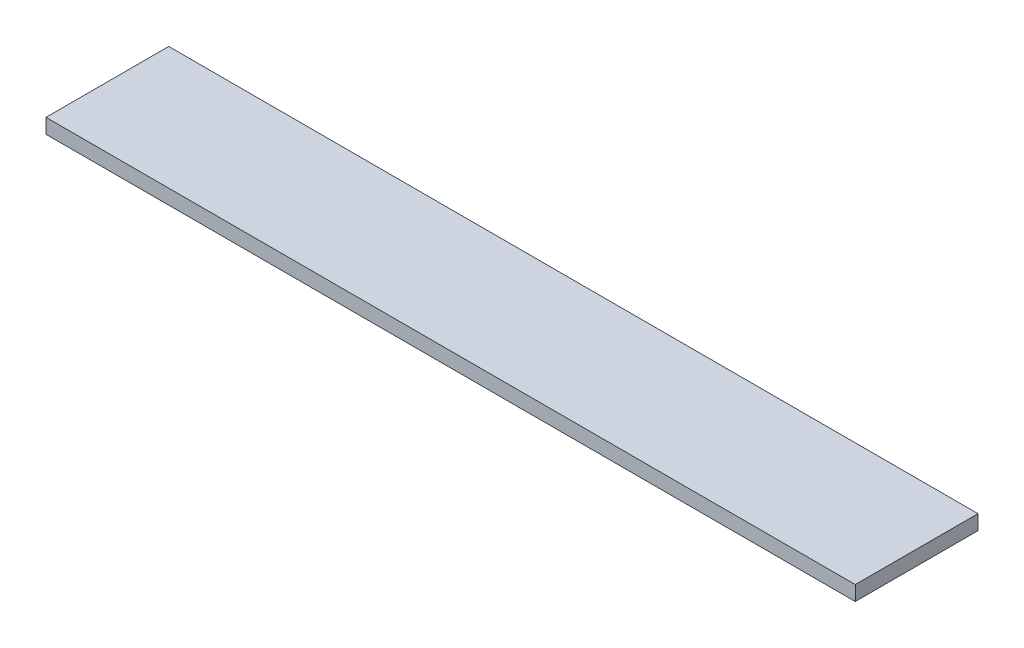
ISO-10303-21;
HEADER;
FILE_DESCRIPTION(('STEP AP214'),'2;1');
FILE_NAME('part.step','',(''),(''),'','','');
FILE_SCHEMA(('AUTOMOTIVE_DESIGN { 1 0 10303 214 1 1 1 1 }'));
ENDSEC;
DATA;
#1=APPLICATION_CONTEXT('core data for automotive mechanical design processes');
#2=APPLICATION_PROTOCOL_DEFINITION('international standard','automotive_design',2000,#1);
#3=PRODUCT_CONTEXT('',#1,'mechanical');
#4=PRODUCT('Part','Part','',(#3));
#5=PRODUCT_RELATED_PRODUCT_CATEGORY('part','',(#4));
#6=PRODUCT_DEFINITION_FORMATION('','',#4);
#7=PRODUCT_DEFINITION_CONTEXT('part definition',#1,'design');
#8=PRODUCT_DEFINITION('design','',#6,#7);
#9=PRODUCT_DEFINITION_SHAPE('','',#8);
#10=(LENGTH_UNIT() NAMED_UNIT(*) SI_UNIT(.MILLI.,.METRE.));
#11=(NAMED_UNIT(*) PLANE_ANGLE_UNIT() SI_UNIT($,.RADIAN.));
#12=(NAMED_UNIT(*) SI_UNIT($,.STERADIAN.) SOLID_ANGLE_UNIT());
#13=UNCERTAINTY_MEASURE_WITH_UNIT(LENGTH_MEASURE(1.E-05),#10,'distance_accuracy_value','');
#14=(GEOMETRIC_REPRESENTATION_CONTEXT(3) GLOBAL_UNCERTAINTY_ASSIGNED_CONTEXT((#13)) GLOBAL_UNIT_ASSIGNED_CONTEXT((#10,
#11,#12)) REPRESENTATION_CONTEXT('',''));
#15=CARTESIAN_POINT('',(0.,0.,0.));
#16=DIRECTION('',(0.,0.,1.));
#17=DIRECTION('',(1.,0.,0.));
#18=AXIS2_PLACEMENT_3D('',#15,#16,#17);
#19=CARTESIAN_POINT('',(-494.5,18.,75.));
#20=DIRECTION('',(1.,0.,0.));
#21=DIRECTION('',(0.,0.,-1.));
#22=AXIS2_PLACEMENT_3D('',#19,#20,#21);
#23=PLANE('',#22);
#24=DIRECTION('',(0.,0.,1.));
#25=VECTOR('',#24,1.);
#26=CARTESIAN_POINT('',(-494.5,0.,75.));
#27=LINE('',#26,#25);
#28=CARTESIAN_POINT('',(-494.5,0.,-75.));
#29=VERTEX_POINT('',#28);
#30=CARTESIAN_POINT('',(-494.5,0.,75.));
#31=VERTEX_POINT('',#30);
#32=EDGE_CURVE('E96',#29,#31,#27,.T.);
#33=ORIENTED_EDGE('',*,*,#32,.T.);
#34=DIRECTION('',(0.,-1.,0.));
#35=VECTOR('',#34,1.);
#36=CARTESIAN_POINT('',(-494.5,18.,75.));
#37=LINE('',#36,#35);
#38=CARTESIAN_POINT('',(-494.5,18.,75.));
#39=VERTEX_POINT('',#38);
#40=EDGE_CURVE('E11',#39,#31,#37,.T.);
#41=ORIENTED_EDGE('',*,*,#40,.F.);
#42=DIRECTION('',(0.,0.,1.));
#43=VECTOR('',#42,1.);
#44=CARTESIAN_POINT('',(-494.5,18.,75.));
#45=LINE('',#44,#43);
#46=CARTESIAN_POINT('',(-494.5,18.,-75.));
#47=VERTEX_POINT('',#46);
#48=EDGE_CURVE('E84',#47,#39,#45,.T.);
#49=ORIENTED_EDGE('',*,*,#48,.F.);
#50=DIRECTION('',(0.,-1.,0.));
#51=VECTOR('',#50,1.);
#52=CARTESIAN_POINT('',(-494.5,18.,-75.));
#53=LINE('',#52,#51);
#54=EDGE_CURVE('E92',#47,#29,#53,.T.);
#55=ORIENTED_EDGE('',*,*,#54,.T.);
#56=EDGE_LOOP('',(#33,#41,#49,#55));
#57=FACE_BOUND('',#56,.T.);
#58=ADVANCED_FACE('F33',(#57),#23,.F.);
#59=CARTESIAN_POINT('',(494.5,18.,74.9999999999999));
#60=DIRECTION('',(0.,0.,-1.));
#61=DIRECTION('',(-1.,0.,0.));
#62=AXIS2_PLACEMENT_3D('',#59,#60,#61);
#63=PLANE('',#62);
#64=DIRECTION('',(1.,0.,0.));
#65=VECTOR('',#64,1.);
#66=CARTESIAN_POINT('',(494.5,0.,74.9999999999999));
#67=LINE('',#66,#65);
#68=CARTESIAN_POINT('',(494.5,0.,74.9999999999999));
#69=VERTEX_POINT('',#68);
#70=EDGE_CURVE('E88',#31,#69,#67,.T.);
#71=ORIENTED_EDGE('',*,*,#70,.T.);
#72=DIRECTION('',(0.,-1.,0.));
#73=VECTOR('',#72,1.);
#74=CARTESIAN_POINT('',(494.5,18.,74.9999999999999));
#75=LINE('',#74,#73);
#76=CARTESIAN_POINT('',(494.5,18.,74.9999999999999));
#77=VERTEX_POINT('',#76);
#78=EDGE_CURVE('E41',#77,#69,#75,.T.);
#79=ORIENTED_EDGE('',*,*,#78,.F.);
#80=DIRECTION('',(1.,0.,0.));
#81=VECTOR('',#80,1.);
#82=CARTESIAN_POINT('',(494.5,18.,74.9999999999999));
#83=LINE('',#82,#81);
#84=EDGE_CURVE('E79',#39,#77,#83,.T.);
#85=ORIENTED_EDGE('',*,*,#84,.F.);
#86=ORIENTED_EDGE('',*,*,#40,.T.);
#87=EDGE_LOOP('',(#71,#79,#85,#86));
#88=FACE_BOUND('',#87,.T.);
#89=ADVANCED_FACE('F87',(#88),#63,.F.);
#90=CARTESIAN_POINT('',(494.5,18.,74.9999999999999));
#91=DIRECTION('',(-1.,0.,0.));
#92=DIRECTION('',(0.,0.,1.));
#93=AXIS2_PLACEMENT_3D('',#90,#91,#92);
#94=PLANE('',#93);
#95=DIRECTION('',(0.,0.,-1.));
#96=VECTOR('',#95,1.);
#97=CARTESIAN_POINT('',(494.5,0.,74.9999999999999));
#98=LINE('',#97,#96);
#99=CARTESIAN_POINT('',(494.5,0.,-75.));
#100=VERTEX_POINT('',#99);
#101=EDGE_CURVE('E66',#69,#100,#98,.T.);
#102=ORIENTED_EDGE('',*,*,#101,.T.);
#103=DIRECTION('',(0.,-1.,0.));
#104=VECTOR('',#103,1.);
#105=CARTESIAN_POINT('',(494.5,18.,-75.));
#106=LINE('',#105,#104);
#107=CARTESIAN_POINT('',(494.5,18.,-75.));
#108=VERTEX_POINT('',#107);
#109=EDGE_CURVE('E89',#108,#100,#106,.T.);
#110=ORIENTED_EDGE('',*,*,#109,.F.);
#111=DIRECTION('',(0.,0.,-1.));
#112=VECTOR('',#111,1.);
#113=CARTESIAN_POINT('',(494.5,18.,74.9999999999999));
#114=LINE('',#113,#112);
#115=EDGE_CURVE('E82',#77,#108,#114,.T.);
#116=ORIENTED_EDGE('',*,*,#115,.F.);
#117=ORIENTED_EDGE('',*,*,#78,.T.);
#118=EDGE_LOOP('',(#102,#110,#116,#117));
#119=FACE_BOUND('',#118,.T.);
#120=ADVANCED_FACE('F90',(#119),#94,.F.);
#121=CARTESIAN_POINT('',(494.5,18.,-75.));
#122=DIRECTION('',(0.,0.,1.));
#123=DIRECTION('',(1.,0.,0.));
#124=AXIS2_PLACEMENT_3D('',#121,#122,#123);
#125=PLANE('',#124);
#126=DIRECTION('',(-1.,0.,0.));
#127=VECTOR('',#126,1.);
#128=CARTESIAN_POINT('',(494.5,0.,-75.));
#129=LINE('',#128,#127);
#130=EDGE_CURVE('E72',#100,#29,#129,.T.);
#131=ORIENTED_EDGE('',*,*,#130,.T.);
#132=ORIENTED_EDGE('',*,*,#54,.F.);
#133=DIRECTION('',(-1.,0.,0.));
#134=VECTOR('',#133,1.);
#135=CARTESIAN_POINT('',(494.5,18.,-75.));
#136=LINE('',#135,#134);
#137=EDGE_CURVE('E49',#108,#47,#136,.T.);
#138=ORIENTED_EDGE('',*,*,#137,.F.);
#139=ORIENTED_EDGE('',*,*,#109,.T.);
#140=EDGE_LOOP('',(#131,#132,#138,#139));
#141=FACE_BOUND('',#140,.T.);
#142=ADVANCED_FACE('F103',(#141),#125,.F.);
#143=CARTESIAN_POINT('',(0.,18.,0.));
#144=DIRECTION('',(0.,1.,0.));
#145=DIRECTION('',(0.,0.,1.));
#146=AXIS2_PLACEMENT_3D('',#143,#144,#145);
#147=PLANE('',#146);
#148=ORIENTED_EDGE('',*,*,#48,.T.);
#149=ORIENTED_EDGE('',*,*,#84,.T.);
#150=ORIENTED_EDGE('',*,*,#115,.T.);
#151=ORIENTED_EDGE('',*,*,#137,.T.);
#152=EDGE_LOOP('',(#148,#149,#150,#151));
#153=FACE_BOUND('',#152,.T.);
#154=ADVANCED_FACE('F80',(#153),#147,.T.);
#155=CARTESIAN_POINT('',(0.,0.,0.));
#156=DIRECTION('',(0.,1.,0.));
#157=DIRECTION('',(0.,0.,1.));
#158=AXIS2_PLACEMENT_3D('',#155,#156,#157);
#159=PLANE('',#158);
#160=ORIENTED_EDGE('',*,*,#32,.F.);
#161=ORIENTED_EDGE('',*,*,#130,.F.);
#162=ORIENTED_EDGE('',*,*,#101,.F.);
#163=ORIENTED_EDGE('',*,*,#70,.F.);
#164=EDGE_LOOP('',(#160,#161,#162,#163));
#165=FACE_BOUND('',#164,.T.);
#166=ADVANCED_FACE('F106',(#165),#159,.F.);
#167=CLOSED_SHELL('',(#58,#89,#120,#142,#154,#166));
#168=MANIFOLD_SOLID_BREP('B2',#167);
#169=ADVANCED_BREP_SHAPE_REPRESENTATION('',(#18,#168),#14);
#170=SHAPE_DEFINITION_REPRESENTATION(#9,#169);
ENDSEC;
END-ISO-10303-21;
